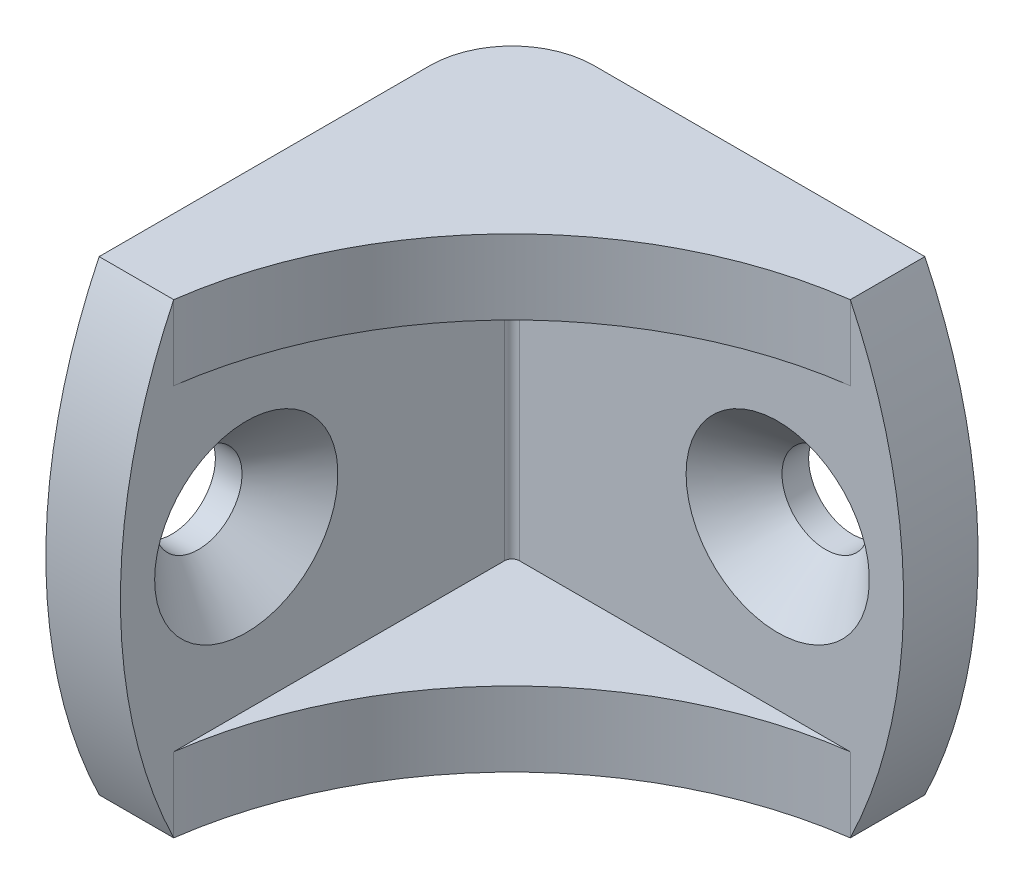
ISO-10303-21;
HEADER;
FILE_DESCRIPTION(('STEP AP214'),'2;1');
FILE_NAME('part.step','',(''),(''),'','','');
FILE_SCHEMA(('AUTOMOTIVE_DESIGN { 1 0 10303 214 1 1 1 1 }'));
ENDSEC;
DATA;
#1=APPLICATION_CONTEXT('core data for automotive mechanical design processes');
#2=APPLICATION_PROTOCOL_DEFINITION('international standard','automotive_design',2000,#1);
#3=PRODUCT_CONTEXT('',#1,'mechanical');
#4=PRODUCT('Part','Part','',(#3));
#5=PRODUCT_RELATED_PRODUCT_CATEGORY('part','',(#4));
#6=PRODUCT_DEFINITION_FORMATION('','',#4);
#7=PRODUCT_DEFINITION_CONTEXT('part definition',#1,'design');
#8=PRODUCT_DEFINITION('design','',#6,#7);
#9=PRODUCT_DEFINITION_SHAPE('','',#8);
#10=(LENGTH_UNIT() NAMED_UNIT(*) SI_UNIT(.MILLI.,.METRE.));
#11=(NAMED_UNIT(*) PLANE_ANGLE_UNIT() SI_UNIT($,.RADIAN.));
#12=(NAMED_UNIT(*) SI_UNIT($,.STERADIAN.) SOLID_ANGLE_UNIT());
#13=UNCERTAINTY_MEASURE_WITH_UNIT(LENGTH_MEASURE(1.E-05),#10,'distance_accuracy_value','');
#14=(GEOMETRIC_REPRESENTATION_CONTEXT(3) GLOBAL_UNCERTAINTY_ASSIGNED_CONTEXT((#13)) GLOBAL_UNIT_ASSIGNED_CONTEXT((#10,
#11,#12)) REPRESENTATION_CONTEXT('',''));
#15=CARTESIAN_POINT('',(0.,0.,0.));
#16=DIRECTION('',(0.,0.,1.));
#17=DIRECTION('',(1.,0.,0.));
#18=AXIS2_PLACEMENT_3D('',#15,#16,#17);
#19=CARTESIAN_POINT('',(3.9116,11.1125,3.556));
#20=DIRECTION('',(0.,0.,-1.));
#21=DIRECTION('',(-1.,0.,0.));
#22=AXIS2_PLACEMENT_3D('',#19,#20,#21);
#23=PLANE('',#22);
#24=CARTESIAN_POINT('',(16.225,0.,3.556));
#25=DIRECTION('',(0.,0.,-1.));
#26=DIRECTION('',(-1.,0.,0.));
#27=AXIS2_PLACEMENT_3D('',#24,#25,#26);
#28=CIRCLE('',#27,4.3688);
#29=CARTESIAN_POINT('',(11.8562,0.,3.556));
#30=VERTEX_POINT('',#29);
#31=EDGE_CURVE('E185',#30,#30,#28,.T.);
#32=ORIENTED_EDGE('',*,*,#31,.T.);
#33=EDGE_LOOP('',(#32));
#34=FACE_BOUND('',#33,.T.);
#35=CARTESIAN_POINT('',(-3.35359375000001,0.,3.556));
#36=DIRECTION('',(0.,0.,-1.));
#37=DIRECTION('',(-1.,0.,0.));
#38=AXIS2_PLACEMENT_3D('',#35,#36,#37);
#39=CIRCLE('',#38,25.57859375);
#40=CARTESIAN_POINT('',(19.685,11.1125,3.55600000000002));
#41=VERTEX_POINT('',#40);
#42=CARTESIAN_POINT('',(19.685,-11.1125,3.556));
#43=VERTEX_POINT('',#42);
#44=EDGE_CURVE('E117',#41,#43,#39,.T.);
#45=ORIENTED_EDGE('',*,*,#44,.F.);
#46=DIRECTION('',(0.,1.,0.));
#47=VECTOR('',#46,1.);
#48=CARTESIAN_POINT('',(19.685,7.5565,3.556));
#49=LINE('',#48,#47);
#50=CARTESIAN_POINT('',(19.685,7.5565,3.556));
#51=VERTEX_POINT('',#50);
#52=EDGE_CURVE('E130',#51,#41,#49,.T.);
#53=ORIENTED_EDGE('',*,*,#52,.F.);
#54=DIRECTION('',(-1.,0.,0.));
#55=VECTOR('',#54,1.);
#56=CARTESIAN_POINT('',(3.9116,7.5565,3.556));
#57=LINE('',#56,#55);
#58=CARTESIAN_POINT('',(3.9116,7.5565,3.556));
#59=VERTEX_POINT('',#58);
#60=EDGE_CURVE('E402',#51,#59,#57,.T.);
#61=ORIENTED_EDGE('',*,*,#60,.T.);
#62=DIRECTION('',(0.,-1.,0.));
#63=VECTOR('',#62,1.);
#64=CARTESIAN_POINT('',(3.9116,11.1125,3.556));
#65=LINE('',#64,#63);
#66=CARTESIAN_POINT('',(3.9116,-7.5565,3.556));
#67=VERTEX_POINT('',#66);
#68=EDGE_CURVE('E165',#59,#67,#65,.T.);
#69=ORIENTED_EDGE('',*,*,#68,.T.);
#70=DIRECTION('',(-1.,0.,0.));
#71=VECTOR('',#70,1.);
#72=CARTESIAN_POINT('',(3.9116,-7.5565,3.556));
#73=LINE('',#72,#71);
#74=CARTESIAN_POINT('',(19.685,-7.5565,3.556));
#75=VERTEX_POINT('',#74);
#76=EDGE_CURVE('E393',#75,#67,#73,.T.);
#77=ORIENTED_EDGE('',*,*,#76,.F.);
#78=DIRECTION('',(0.,-1.,0.));
#79=VECTOR('',#78,1.);
#80=CARTESIAN_POINT('',(19.685,-7.5565,3.556));
#81=LINE('',#80,#79);
#82=EDGE_CURVE('E132',#75,#43,#81,.T.);
#83=ORIENTED_EDGE('',*,*,#82,.T.);
#84=EDGE_LOOP('',(#45,#53,#61,#69,#77,#83));
#85=FACE_BOUND('',#84,.T.);
#86=ADVANCED_FACE('F36',(#34,#85),#23,.F.);
#87=CARTESIAN_POINT('',(3.9116,11.1125,0.));
#88=DIRECTION('',(0.,0.,-1.));
#89=DIRECTION('',(-1.,0.,0.));
#90=AXIS2_PLACEMENT_3D('',#87,#88,#89);
#91=PLANE('',#90);
#92=CARTESIAN_POINT('',(16.225,0.,0.));
#93=DIRECTION('',(0.,0.,-1.));
#94=DIRECTION('',(-1.,0.,0.));
#95=AXIS2_PLACEMENT_3D('',#92,#93,#94);
#96=CIRCLE('',#95,2.0828);
#97=CARTESIAN_POINT('',(14.1422,0.,0.));
#98=VERTEX_POINT('',#97);
#99=EDGE_CURVE('E134',#98,#98,#96,.T.);
#100=ORIENTED_EDGE('',*,*,#99,.F.);
#101=EDGE_LOOP('',(#100));
#102=FACE_BOUND('',#101,.T.);
#103=DIRECTION('',(1.,0.,0.));
#104=VECTOR('',#103,1.);
#105=CARTESIAN_POINT('',(3.9116,11.1125,0.));
#106=LINE('',#105,#104);
#107=CARTESIAN_POINT('',(3.9116,11.1125,0.));
#108=VERTEX_POINT('',#107);
#109=CARTESIAN_POINT('',(19.685,11.1125,0.));
#110=VERTEX_POINT('',#109);
#111=EDGE_CURVE('E157',#108,#110,#106,.T.);
#112=ORIENTED_EDGE('',*,*,#111,.T.);
#113=CARTESIAN_POINT('',(-3.35359374999999,0.,0.));
#114=DIRECTION('',(0.,0.,-1.));
#115=DIRECTION('',(-1.,0.,0.));
#116=AXIS2_PLACEMENT_3D('',#113,#114,#115);
#117=CIRCLE('',#116,25.57859375);
#118=CARTESIAN_POINT('',(19.685,-11.1125,0.));
#119=VERTEX_POINT('',#118);
#120=EDGE_CURVE('E119',#110,#119,#117,.T.);
#121=ORIENTED_EDGE('',*,*,#120,.T.);
#122=DIRECTION('',(1.,0.,0.));
#123=VECTOR('',#122,1.);
#124=CARTESIAN_POINT('',(3.9116,-11.1125,0.));
#125=LINE('',#124,#123);
#126=CARTESIAN_POINT('',(3.9116,-11.1125,0.));
#127=VERTEX_POINT('',#126);
#128=EDGE_CURVE('E151',#127,#119,#125,.T.);
#129=ORIENTED_EDGE('',*,*,#128,.F.);
#130=DIRECTION('',(0.,-1.,0.));
#131=VECTOR('',#130,1.);
#132=CARTESIAN_POINT('',(3.9116,11.1125,0.));
#133=LINE('',#132,#131);
#134=EDGE_CURVE('E180',#108,#127,#133,.T.);
#135=ORIENTED_EDGE('',*,*,#134,.F.);
#136=EDGE_LOOP('',(#112,#121,#129,#135));
#137=FACE_BOUND('',#136,.T.);
#138=ADVANCED_FACE('F205',(#102,#137),#91,.T.);
#139=CARTESIAN_POINT('',(3.9116,11.1125,3.9116));
#140=DIRECTION('',(0.,-1.,0.));
#141=DIRECTION('',(-1.,0.,0.));
#142=AXIS2_PLACEMENT_3D('',#139,#140,#141);
#143=PLANE('',#142);
#144=DIRECTION('',(0.,0.,-1.));
#145=VECTOR('',#144,1.);
#146=CARTESIAN_POINT('',(19.6849999999998,11.1125,51.6745364977729));
#147=LINE('',#146,#145);
#148=EDGE_CURVE('E113',#41,#110,#147,.T.);
#149=ORIENTED_EDGE('',*,*,#148,.T.);
#150=ORIENTED_EDGE('',*,*,#111,.F.);
#151=CARTESIAN_POINT('',(3.9116,11.1125,3.9116));
#152=DIRECTION('',(0.,-1.,0.));
#153=DIRECTION('',(0.,0.,1.));
#154=AXIS2_PLACEMENT_3D('',#151,#152,#153);
#155=CIRCLE('',#154,3.9116);
#156=CARTESIAN_POINT('',(0.,11.1125,3.9116));
#157=VERTEX_POINT('',#156);
#158=EDGE_CURVE('E159',#157,#108,#155,.T.);
#159=ORIENTED_EDGE('',*,*,#158,.F.);
#160=DIRECTION('',(0.,0.,-1.));
#161=VECTOR('',#160,1.);
#162=CARTESIAN_POINT('',(0.,11.1125,22.225));
#163=LINE('',#162,#161);
#164=CARTESIAN_POINT('',(0.,11.1125,19.685));
#165=VERTEX_POINT('',#164);
#166=EDGE_CURVE('E163',#165,#157,#163,.T.);
#167=ORIENTED_EDGE('',*,*,#166,.F.);
#168=DIRECTION('',(-1.,0.,0.));
#169=VECTOR('',#168,1.);
#170=CARTESIAN_POINT('',(51.6745364977729,11.1125,19.685));
#171=LINE('',#170,#169);
#172=CARTESIAN_POINT('',(3.556,11.1125,19.685));
#173=VERTEX_POINT('',#172);
#174=EDGE_CURVE('E140',#173,#165,#171,.T.);
#175=ORIENTED_EDGE('',*,*,#174,.F.);
#176=CARTESIAN_POINT('',(22.225,11.1125,22.225));
#177=DIRECTION('',(0.,-1.,0.));
#178=DIRECTION('',(0.,0.,-1.));
#179=AXIS2_PLACEMENT_3D('',#176,#177,#178);
#180=CIRCLE('',#179,18.8409968154554);
#181=EDGE_CURVE('E137',#173,#41,#180,.T.);
#182=ORIENTED_EDGE('',*,*,#181,.T.);
#183=EDGE_LOOP('',(#149,#150,#159,#167,#175,#182));
#184=FACE_BOUND('',#183,.T.);
#185=ADVANCED_FACE('F138',(#184),#143,.F.);
#186=CARTESIAN_POINT('',(3.9116,-11.1125,3.9116));
#187=DIRECTION('',(0.,-1.,0.));
#188=DIRECTION('',(-1.,0.,0.));
#189=AXIS2_PLACEMENT_3D('',#186,#187,#188);
#190=PLANE('',#189);
#191=ORIENTED_EDGE('',*,*,#128,.T.);
#192=DIRECTION('',(0.,0.,-1.));
#193=VECTOR('',#192,1.);
#194=CARTESIAN_POINT('',(19.6849999999998,-11.1125,51.6745364977729));
#195=LINE('',#194,#193);
#196=EDGE_CURVE('E183',#119,#43,#195,.F.);
#197=ORIENTED_EDGE('',*,*,#196,.T.);
#198=CARTESIAN_POINT('',(22.225,-11.1125,22.225));
#199=DIRECTION('',(0.,-1.,0.));
#200=DIRECTION('',(0.,0.,-1.));
#201=AXIS2_PLACEMENT_3D('',#198,#199,#200);
#202=CIRCLE('',#201,18.8409968154554);
#203=CARTESIAN_POINT('',(3.556,-11.1125,19.685));
#204=VERTEX_POINT('',#203);
#205=EDGE_CURVE('E383',#204,#43,#202,.T.);
#206=ORIENTED_EDGE('',*,*,#205,.F.);
#207=DIRECTION('',(-1.,0.,0.));
#208=VECTOR('',#207,1.);
#209=CARTESIAN_POINT('',(51.6745364977729,-11.1125,19.685));
#210=LINE('',#209,#208);
#211=CARTESIAN_POINT('',(0.,-11.1125,19.685));
#212=VERTEX_POINT('',#211);
#213=EDGE_CURVE('E59',#212,#204,#210,.F.);
#214=ORIENTED_EDGE('',*,*,#213,.F.);
#215=DIRECTION('',(0.,0.,-1.));
#216=VECTOR('',#215,1.);
#217=CARTESIAN_POINT('',(0.,-11.1125,22.225));
#218=LINE('',#217,#216);
#219=CARTESIAN_POINT('',(0.,-11.1125,3.9116));
#220=VERTEX_POINT('',#219);
#221=EDGE_CURVE('E160',#212,#220,#218,.T.);
#222=ORIENTED_EDGE('',*,*,#221,.T.);
#223=CARTESIAN_POINT('',(3.9116,-11.1125,3.9116));
#224=DIRECTION('',(0.,-1.,0.));
#225=DIRECTION('',(0.,0.,1.));
#226=AXIS2_PLACEMENT_3D('',#223,#224,#225);
#227=CIRCLE('',#226,3.9116);
#228=EDGE_CURVE('E168',#220,#127,#227,.T.);
#229=ORIENTED_EDGE('',*,*,#228,.T.);
#230=EDGE_LOOP('',(#191,#197,#206,#214,#222,#229));
#231=FACE_BOUND('',#230,.T.);
#232=ADVANCED_FACE('F225',(#231),#190,.T.);
#233=CARTESIAN_POINT('',(3.556,11.1125,22.225));
#234=DIRECTION('',(-1.,0.,0.));
#235=DIRECTION('',(0.,0.,1.));
#236=AXIS2_PLACEMENT_3D('',#233,#234,#235);
#237=PLANE('',#236);
#238=CARTESIAN_POINT('',(3.556,0.,16.225));
#239=DIRECTION('',(-1.,0.,0.));
#240=DIRECTION('',(0.,0.,1.));
#241=AXIS2_PLACEMENT_3D('',#238,#239,#240);
#242=CIRCLE('',#241,4.3688);
#243=CARTESIAN_POINT('',(3.556,0.,20.5938));
#244=VERTEX_POINT('',#243);
#245=EDGE_CURVE('E11',#244,#244,#242,.T.);
#246=ORIENTED_EDGE('',*,*,#245,.T.);
#247=EDGE_LOOP('',(#246));
#248=FACE_BOUND('',#247,.T.);
#249=CARTESIAN_POINT('',(3.556,0.,-3.35359374999999));
#250=DIRECTION('',(-1.,0.,0.));
#251=DIRECTION('',(0.,0.,1.));
#252=AXIS2_PLACEMENT_3D('',#249,#250,#251);
#253=CIRCLE('',#252,25.57859375);
#254=EDGE_CURVE('E374',#173,#204,#253,.F.);
#255=ORIENTED_EDGE('',*,*,#254,.T.);
#256=DIRECTION('',(0.,-1.,0.));
#257=VECTOR('',#256,1.);
#258=CARTESIAN_POINT('',(3.556,-7.5565,19.685));
#259=LINE('',#258,#257);
#260=CARTESIAN_POINT('',(3.556,-7.5565,19.685));
#261=VERTEX_POINT('',#260);
#262=EDGE_CURVE('E396',#261,#204,#259,.T.);
#263=ORIENTED_EDGE('',*,*,#262,.F.);
#264=DIRECTION('',(0.,0.,1.));
#265=VECTOR('',#264,1.);
#266=CARTESIAN_POINT('',(3.556,-7.5565,19.685));
#267=LINE('',#266,#265);
#268=CARTESIAN_POINT('',(3.556,-7.5565,3.9116));
#269=VERTEX_POINT('',#268);
#270=EDGE_CURVE('E387',#269,#261,#267,.T.);
#271=ORIENTED_EDGE('',*,*,#270,.F.);
#272=DIRECTION('',(0.,-1.,0.));
#273=VECTOR('',#272,1.);
#274=CARTESIAN_POINT('',(3.556,11.1125,3.9116));
#275=LINE('',#274,#273);
#276=CARTESIAN_POINT('',(3.556,7.5565,3.9116));
#277=VERTEX_POINT('',#276);
#278=EDGE_CURVE('E174',#277,#269,#275,.T.);
#279=ORIENTED_EDGE('',*,*,#278,.F.);
#280=DIRECTION('',(0.,0.,1.));
#281=VECTOR('',#280,1.);
#282=CARTESIAN_POINT('',(3.556,7.5565,19.685));
#283=LINE('',#282,#281);
#284=CARTESIAN_POINT('',(3.556,7.5565,19.685));
#285=VERTEX_POINT('',#284);
#286=EDGE_CURVE('E149',#277,#285,#283,.T.);
#287=ORIENTED_EDGE('',*,*,#286,.T.);
#288=DIRECTION('',(0.,1.,0.));
#289=VECTOR('',#288,1.);
#290=CARTESIAN_POINT('',(3.556,7.5565,19.685));
#291=LINE('',#290,#289);
#292=EDGE_CURVE('E148',#285,#173,#291,.T.);
#293=ORIENTED_EDGE('',*,*,#292,.T.);
#294=EDGE_LOOP('',(#255,#263,#271,#279,#287,#293));
#295=FACE_BOUND('',#294,.T.);
#296=ADVANCED_FACE('F222',(#248,#295),#237,.F.);
#297=CARTESIAN_POINT('',(0.,11.1125,22.225));
#298=DIRECTION('',(-1.,0.,0.));
#299=DIRECTION('',(0.,0.,1.));
#300=AXIS2_PLACEMENT_3D('',#297,#298,#299);
#301=PLANE('',#300);
#302=CARTESIAN_POINT('',(0.,0.,-3.35359374999999));
#303=DIRECTION('',(-1.,0.,0.));
#304=DIRECTION('',(0.,0.,1.));
#305=AXIS2_PLACEMENT_3D('',#302,#303,#304);
#306=CIRCLE('',#305,25.57859375);
#307=EDGE_CURVE('E51',#165,#212,#306,.F.);
#308=ORIENTED_EDGE('',*,*,#307,.F.);
#309=ORIENTED_EDGE('',*,*,#166,.T.);
#310=DIRECTION('',(0.,-1.,0.));
#311=VECTOR('',#310,1.);
#312=CARTESIAN_POINT('',(0.,11.1125,3.9116));
#313=LINE('',#312,#311);
#314=EDGE_CURVE('E177',#157,#220,#313,.T.);
#315=ORIENTED_EDGE('',*,*,#314,.T.);
#316=ORIENTED_EDGE('',*,*,#221,.F.);
#317=EDGE_LOOP('',(#308,#309,#315,#316));
#318=FACE_BOUND('',#317,.T.);
#319=CARTESIAN_POINT('',(0.,0.,16.225));
#320=DIRECTION('',(1.,0.,0.));
#321=DIRECTION('',(0.,0.,-1.));
#322=AXIS2_PLACEMENT_3D('',#319,#320,#321);
#323=CIRCLE('',#322,2.0828);
#324=CARTESIAN_POINT('',(0.,0.,14.1422));
#325=VERTEX_POINT('',#324);
#326=EDGE_CURVE('E379',#325,#325,#323,.T.);
#327=ORIENTED_EDGE('',*,*,#326,.T.);
#328=EDGE_LOOP('',(#327));
#329=FACE_BOUND('',#328,.T.);
#330=ADVANCED_FACE('F218',(#318,#329),#301,.T.);
#331=CARTESIAN_POINT('',(3.9116,11.1125,3.9116));
#332=DIRECTION('',(0.,-1.,0.));
#333=DIRECTION('',(0.,0.,-1.));
#334=AXIS2_PLACEMENT_3D('',#331,#332,#333);
#335=CYLINDRICAL_SURFACE('',#334,3.9116);
#336=ORIENTED_EDGE('',*,*,#228,.F.);
#337=ORIENTED_EDGE('',*,*,#314,.F.);
#338=ORIENTED_EDGE('',*,*,#158,.T.);
#339=ORIENTED_EDGE('',*,*,#134,.T.);
#340=EDGE_LOOP('',(#336,#337,#338,#339));
#341=FACE_BOUND('',#340,.T.);
#342=ADVANCED_FACE('F214',(#341),#335,.T.);
#343=CARTESIAN_POINT('',(3.9116,11.1125,3.9116));
#344=DIRECTION('',(0.,-1.,0.));
#345=DIRECTION('',(0.,0.,-1.));
#346=AXIS2_PLACEMENT_3D('',#343,#344,#345);
#347=CYLINDRICAL_SURFACE('',#346,0.3556);
#348=ORIENTED_EDGE('',*,*,#278,.T.);
#349=CARTESIAN_POINT('',(3.9116,-7.5565,3.9116));
#350=DIRECTION('',(0.,1.,0.));
#351=DIRECTION('',(0.,0.,1.));
#352=AXIS2_PLACEMENT_3D('',#349,#350,#351);
#353=CIRCLE('',#352,0.3556);
#354=EDGE_CURVE('E390',#67,#269,#353,.T.);
#355=ORIENTED_EDGE('',*,*,#354,.F.);
#356=ORIENTED_EDGE('',*,*,#68,.F.);
#357=CARTESIAN_POINT('',(3.9116,7.5565,3.9116));
#358=DIRECTION('',(0.,1.,0.));
#359=DIRECTION('',(0.,0.,1.));
#360=AXIS2_PLACEMENT_3D('',#357,#358,#359);
#361=CIRCLE('',#360,0.3556);
#362=EDGE_CURVE('E154',#59,#277,#361,.T.);
#363=ORIENTED_EDGE('',*,*,#362,.T.);
#364=EDGE_LOOP('',(#348,#355,#356,#363));
#365=FACE_BOUND('',#364,.T.);
#366=ADVANCED_FACE('F217',(#365),#347,.F.);
#367=CARTESIAN_POINT('',(22.225,7.5565,22.225));
#368=DIRECTION('',(0.,1.,0.));
#369=DIRECTION('',(0.,0.,1.));
#370=AXIS2_PLACEMENT_3D('',#367,#368,#369);
#371=CYLINDRICAL_SURFACE('',#370,18.8409968154554);
#372=ORIENTED_EDGE('',*,*,#181,.F.);
#373=ORIENTED_EDGE('',*,*,#292,.F.);
#374=CARTESIAN_POINT('',(22.225,7.5565,22.225));
#375=DIRECTION('',(0.,-1.,0.));
#376=DIRECTION('',(0.,0.,-1.));
#377=AXIS2_PLACEMENT_3D('',#374,#375,#376);
#378=CIRCLE('',#377,18.8409968154554);
#379=EDGE_CURVE('E143',#285,#51,#378,.T.);
#380=ORIENTED_EDGE('',*,*,#379,.T.);
#381=ORIENTED_EDGE('',*,*,#52,.T.);
#382=EDGE_LOOP('',(#372,#373,#380,#381));
#383=FACE_BOUND('',#382,.T.);
#384=ADVANCED_FACE('F146',(#383),#371,.F.);
#385=CARTESIAN_POINT('',(22.225,7.5565,22.225));
#386=DIRECTION('',(0.,-1.,0.));
#387=DIRECTION('',(0.,0.,-1.));
#388=AXIS2_PLACEMENT_3D('',#385,#386,#387);
#389=PLANE('',#388);
#390=ORIENTED_EDGE('',*,*,#379,.F.);
#391=ORIENTED_EDGE('',*,*,#286,.F.);
#392=ORIENTED_EDGE('',*,*,#362,.F.);
#393=ORIENTED_EDGE('',*,*,#60,.F.);
#394=EDGE_LOOP('',(#390,#391,#392,#393));
#395=FACE_BOUND('',#394,.T.);
#396=ADVANCED_FACE('F236',(#395),#389,.T.);
#397=CARTESIAN_POINT('',(22.225,-7.5565,22.225));
#398=DIRECTION('',(0.,-1.,0.));
#399=DIRECTION('',(0.,0.,-1.));
#400=AXIS2_PLACEMENT_3D('',#397,#398,#399);
#401=CYLINDRICAL_SURFACE('',#400,18.8409968154554);
#402=ORIENTED_EDGE('',*,*,#205,.T.);
#403=ORIENTED_EDGE('',*,*,#82,.F.);
#404=CARTESIAN_POINT('',(22.225,-7.5565,22.225));
#405=DIRECTION('',(0.,-1.,0.));
#406=DIRECTION('',(0.,0.,-1.));
#407=AXIS2_PLACEMENT_3D('',#404,#405,#406);
#408=CIRCLE('',#407,18.8409968154554);
#409=EDGE_CURVE('E384',#261,#75,#408,.T.);
#410=ORIENTED_EDGE('',*,*,#409,.F.);
#411=ORIENTED_EDGE('',*,*,#262,.T.);
#412=EDGE_LOOP('',(#402,#403,#410,#411));
#413=FACE_BOUND('',#412,.T.);
#414=ADVANCED_FACE('F239',(#413),#401,.F.);
#415=CARTESIAN_POINT('',(22.225,-7.5565,22.225));
#416=DIRECTION('',(0.,1.,0.));
#417=DIRECTION('',(0.,0.,-1.));
#418=AXIS2_PLACEMENT_3D('',#415,#416,#417);
#419=PLANE('',#418);
#420=ORIENTED_EDGE('',*,*,#409,.T.);
#421=ORIENTED_EDGE('',*,*,#76,.T.);
#422=ORIENTED_EDGE('',*,*,#354,.T.);
#423=ORIENTED_EDGE('',*,*,#270,.T.);
#424=EDGE_LOOP('',(#420,#421,#422,#423));
#425=FACE_BOUND('',#424,.T.);
#426=ADVANCED_FACE('F243',(#425),#419,.T.);
#427=CARTESIAN_POINT('',(22.225,0.,16.225));
#428=DIRECTION('',(-1.,0.,0.));
#429=DIRECTION('',(0.,0.,1.));
#430=AXIS2_PLACEMENT_3D('',#427,#428,#429);
#431=CYLINDRICAL_SURFACE('',#430,2.0828);
#432=CARTESIAN_POINT('',(1.27000000000001,0.,16.225));
#433=DIRECTION('',(-1.,0.,0.));
#434=DIRECTION('',(0.,0.,1.));
#435=AXIS2_PLACEMENT_3D('',#432,#433,#434);
#436=CIRCLE('',#435,2.0828);
#437=CARTESIAN_POINT('',(1.27000000000001,0.,18.3078));
#438=VERTEX_POINT('',#437);
#439=EDGE_CURVE('E44',#438,#438,#436,.F.);
#440=ORIENTED_EDGE('',*,*,#439,.T.);
#441=EDGE_LOOP('',(#440));
#442=FACE_BOUND('',#441,.T.);
#443=ORIENTED_EDGE('',*,*,#326,.F.);
#444=EDGE_LOOP('',(#443));
#445=FACE_BOUND('',#444,.T.);
#446=ADVANCED_FACE('F193',(#442,#445),#431,.F.);
#447=CARTESIAN_POINT('',(51.6745364977729,0.,-3.35359374999999));
#448=DIRECTION('',(-1.,0.,0.));
#449=DIRECTION('',(0.,0.,1.));
#450=AXIS2_PLACEMENT_3D('',#447,#448,#449);
#451=CYLINDRICAL_SURFACE('',#450,25.57859375);
#452=ORIENTED_EDGE('',*,*,#213,.T.);
#453=ORIENTED_EDGE('',*,*,#254,.F.);
#454=ORIENTED_EDGE('',*,*,#174,.T.);
#455=ORIENTED_EDGE('',*,*,#307,.T.);
#456=EDGE_LOOP('',(#452,#453,#454,#455));
#457=FACE_BOUND('',#456,.T.);
#458=ADVANCED_FACE('F250',(#457),#451,.T.);
#459=CARTESIAN_POINT('',(16.2249999999999,0.,22.2250000000001));
#460=DIRECTION('',(0.,0.,-1.));
#461=DIRECTION('',(-1.,0.,0.));
#462=AXIS2_PLACEMENT_3D('',#459,#460,#461);
#463=CYLINDRICAL_SURFACE('',#462,2.0828);
#464=CARTESIAN_POINT('',(16.225,0.,1.26999999999999));
#465=DIRECTION('',(0.,0.,-1.));
#466=DIRECTION('',(-1.,0.,0.));
#467=AXIS2_PLACEMENT_3D('',#464,#465,#466);
#468=CIRCLE('',#467,2.0828);
#469=CARTESIAN_POINT('',(14.1422,0.,1.26999999999998));
#470=VERTEX_POINT('',#469);
#471=EDGE_CURVE('E188',#470,#470,#468,.F.);
#472=ORIENTED_EDGE('',*,*,#471,.T.);
#473=EDGE_LOOP('',(#472));
#474=FACE_BOUND('',#473,.T.);
#475=ORIENTED_EDGE('',*,*,#99,.T.);
#476=EDGE_LOOP('',(#475));
#477=FACE_BOUND('',#476,.T.);
#478=ADVANCED_FACE('F253',(#474,#477),#463,.F.);
#479=CARTESIAN_POINT('',(-3.35359375000018,0.,51.6745364977729));
#480=DIRECTION('',(0.,0.,-1.));
#481=DIRECTION('',(-1.,0.,0.));
#482=AXIS2_PLACEMENT_3D('',#479,#480,#481);
#483=CYLINDRICAL_SURFACE('',#482,25.57859375);
#484=ORIENTED_EDGE('',*,*,#148,.F.);
#485=ORIENTED_EDGE('',*,*,#44,.T.);
#486=ORIENTED_EDGE('',*,*,#196,.F.);
#487=ORIENTED_EDGE('',*,*,#120,.F.);
#488=EDGE_LOOP('',(#484,#485,#486,#487));
#489=FACE_BOUND('',#488,.T.);
#490=ADVANCED_FACE('F115',(#489),#483,.T.);
#491=CARTESIAN_POINT('',(16.225,0.,3.556));
#492=DIRECTION('',(0.,0.,1.));
#493=DIRECTION('',(1.,0.,0.));
#494=AXIS2_PLACEMENT_3D('',#491,#492,#493);
#495=CONICAL_SURFACE('',#494,4.36879999999999,0.785398163397445);
#496=ORIENTED_EDGE('',*,*,#471,.F.);
#497=EDGE_LOOP('',(#496));
#498=FACE_BOUND('',#497,.T.);
#499=ORIENTED_EDGE('',*,*,#31,.F.);
#500=EDGE_LOOP('',(#499));
#501=FACE_BOUND('',#500,.T.);
#502=ADVANCED_FACE('F197',(#498,#501),#495,.F.);
#503=CARTESIAN_POINT('',(1.27000000000001,0.,16.225));
#504=DIRECTION('',(1.,0.,0.));
#505=DIRECTION('',(0.,0.,-1.));
#506=AXIS2_PLACEMENT_3D('',#503,#504,#505);
#507=CONICAL_SURFACE('',#506,2.0828,0.785398163397451);
#508=ORIENTED_EDGE('',*,*,#245,.F.);
#509=EDGE_LOOP('',(#508));
#510=FACE_BOUND('',#509,.T.);
#511=ORIENTED_EDGE('',*,*,#439,.F.);
#512=EDGE_LOOP('',(#511));
#513=FACE_BOUND('',#512,.T.);
#514=ADVANCED_FACE('F38',(#510,#513),#507,.F.);
#515=CLOSED_SHELL('',(#86,#138,#185,#232,#296,#330,#342,#366,#384,#396,#414,#426,#446,#458,#478,
#490,#502,#514));
#516=MANIFOLD_SOLID_BREP('B2',#515);
#517=ADVANCED_BREP_SHAPE_REPRESENTATION('',(#18,#516),#14);
#518=SHAPE_DEFINITION_REPRESENTATION(#9,#517);
ENDSEC;
END-ISO-10303-21;
